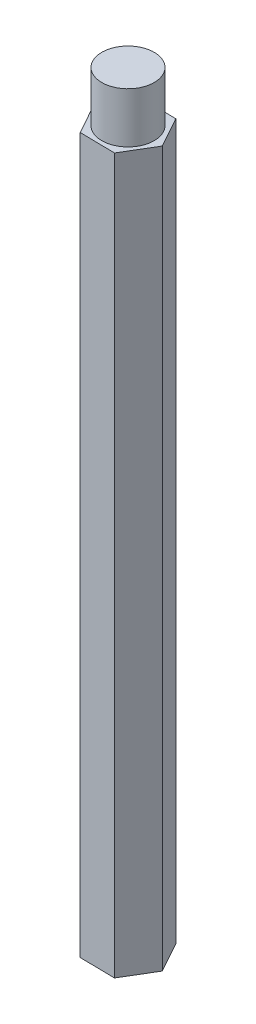
ISO-10303-21;
HEADER;
FILE_DESCRIPTION(('STEP AP214'),'2;1');
FILE_NAME('part.step','',(''),(''),'','','');
FILE_SCHEMA(('AUTOMOTIVE_DESIGN { 1 0 10303 214 1 1 1 1 }'));
ENDSEC;
DATA;
#1=APPLICATION_CONTEXT('core data for automotive mechanical design processes');
#2=APPLICATION_PROTOCOL_DEFINITION('international standard','automotive_design',2000,#1);
#3=PRODUCT_CONTEXT('',#1,'mechanical');
#4=PRODUCT('Part','Part','',(#3));
#5=PRODUCT_RELATED_PRODUCT_CATEGORY('part','',(#4));
#6=PRODUCT_DEFINITION_FORMATION('','',#4);
#7=PRODUCT_DEFINITION_CONTEXT('part definition',#1,'design');
#8=PRODUCT_DEFINITION('design','',#6,#7);
#9=PRODUCT_DEFINITION_SHAPE('','',#8);
#10=(LENGTH_UNIT() NAMED_UNIT(*) SI_UNIT(.MILLI.,.METRE.));
#11=(NAMED_UNIT(*) PLANE_ANGLE_UNIT() SI_UNIT($,.RADIAN.));
#12=(NAMED_UNIT(*) SI_UNIT($,.STERADIAN.) SOLID_ANGLE_UNIT());
#13=UNCERTAINTY_MEASURE_WITH_UNIT(LENGTH_MEASURE(1.E-05),#10,'distance_accuracy_value','');
#14=(GEOMETRIC_REPRESENTATION_CONTEXT(3) GLOBAL_UNCERTAINTY_ASSIGNED_CONTEXT((#13)) GLOBAL_UNIT_ASSIGNED_CONTEXT((#10,
#11,#12)) REPRESENTATION_CONTEXT('',''));
#15=CARTESIAN_POINT('',(0.,0.,0.));
#16=DIRECTION('',(0.,0.,1.));
#17=DIRECTION('',(1.,0.,0.));
#18=AXIS2_PLACEMENT_3D('',#15,#16,#17);
#19=CARTESIAN_POINT('',(-1.12669986382494,45.,1.88251978746312));
#20=DIRECTION('',(0.0157210096493327,0.,-0.99987641729146));
#21=DIRECTION('',(-0.99987641729146,0.,-0.0157210096493327));
#22=AXIS2_PLACEMENT_3D('',#19,#20,#21);
#23=PLANE('',#22);
#24=DIRECTION('',(0.99987641729146,0.,0.0157210096493327));
#25=VECTOR('',#24,1.);
#26=CARTESIAN_POINT('',(-1.12669986382494,0.,1.88251978746312));
#27=LINE('',#26,#25);
#28=CARTESIAN_POINT('',(-1.12669986382494,0.,1.88251978746312));
#29=VERTEX_POINT('',#28);
#30=CARTESIAN_POINT('',(1.06696002715747,0.,1.91701059824443));
#31=VERTEX_POINT('',#30);
#32=EDGE_CURVE('E119',#29,#31,#27,.T.);
#33=ORIENTED_EDGE('',*,*,#32,.T.);
#34=DIRECTION('',(0.,-1.,0.));
#35=VECTOR('',#34,1.);
#36=CARTESIAN_POINT('',(1.06696002715747,45.,1.91701059824443));
#37=LINE('',#36,#35);
#38=CARTESIAN_POINT('',(1.06696002715747,45.,1.91701059824443));
#39=VERTEX_POINT('',#38);
#40=EDGE_CURVE('E36',#39,#31,#37,.T.);
#41=ORIENTED_EDGE('',*,*,#40,.F.);
#42=DIRECTION('',(0.99987641729146,0.,0.0157210096493327));
#43=VECTOR('',#42,1.);
#44=CARTESIAN_POINT('',(-1.12669986382494,45.,1.88251978746312));
#45=LINE('',#44,#43);
#46=CARTESIAN_POINT('',(-1.12669986382494,45.,1.88251978746312));
#47=VERTEX_POINT('',#46);
#48=EDGE_CURVE('E130',#47,#39,#45,.T.);
#49=ORIENTED_EDGE('',*,*,#48,.F.);
#50=DIRECTION('',(0.,-1.,0.));
#51=VECTOR('',#50,1.);
#52=CARTESIAN_POINT('',(-1.12669986382494,45.,1.88251978746312));
#53=LINE('',#52,#51);
#54=EDGE_CURVE('E115',#47,#29,#53,.T.);
#55=ORIENTED_EDGE('',*,*,#54,.T.);
#56=EDGE_LOOP('',(#33,#41,#49,#55));
#57=FACE_BOUND('',#56,.T.);
#58=ADVANCED_FACE('F33',(#57),#23,.F.);
#59=CARTESIAN_POINT('',(1.06696002715747,45.,1.91701059824443));
#60=DIRECTION('',(-0.858057873194708,0.,-0.513553002375192));
#61=DIRECTION('',(-0.513553002375192,0.,0.858057873194708));
#62=AXIS2_PLACEMENT_3D('',#59,#60,#61);
#63=PLANE('',#62);
#64=DIRECTION('',(0.513553002375192,0.,-0.858057873194708));
#65=VECTOR('',#64,1.);
#66=CARTESIAN_POINT('',(1.06696002715747,0.,1.91701059824443));
#67=LINE('',#66,#65);
#68=CARTESIAN_POINT('',(2.19365989098241,0.,0.0344908107813044));
#69=VERTEX_POINT('',#68);
#70=EDGE_CURVE('E122',#31,#69,#67,.T.);
#71=ORIENTED_EDGE('',*,*,#70,.T.);
#72=DIRECTION('',(0.,-1.,0.));
#73=VECTOR('',#72,1.);
#74=CARTESIAN_POINT('',(2.19365989098241,45.,0.0344908107813044));
#75=LINE('',#74,#73);
#76=CARTESIAN_POINT('',(2.19365989098241,45.,0.0344908107813044));
#77=VERTEX_POINT('',#76);
#78=EDGE_CURVE('E133',#77,#69,#75,.T.);
#79=ORIENTED_EDGE('',*,*,#78,.F.);
#80=DIRECTION('',(0.513553002375192,0.,-0.858057873194708));
#81=VECTOR('',#80,1.);
#82=CARTESIAN_POINT('',(1.06696002715747,45.,1.91701059824443));
#83=LINE('',#82,#81);
#84=EDGE_CURVE('E88',#39,#77,#83,.T.);
#85=ORIENTED_EDGE('',*,*,#84,.F.);
#86=ORIENTED_EDGE('',*,*,#40,.T.);
#87=EDGE_LOOP('',(#71,#79,#85,#86));
#88=FACE_BOUND('',#87,.T.);
#89=ADVANCED_FACE('F138',(#88),#63,.F.);
#90=CARTESIAN_POINT('',(2.19365989098241,45.,0.0344908107813044));
#91=DIRECTION('',(-0.873778882844041,0.,0.486323414916268));
#92=DIRECTION('',(0.486323414916268,0.,0.873778882844041));
#93=AXIS2_PLACEMENT_3D('',#90,#91,#92);
#94=PLANE('',#93);
#95=DIRECTION('',(-0.486323414916268,0.,-0.873778882844041));
#96=VECTOR('',#95,1.);
#97=CARTESIAN_POINT('',(2.19365989098241,0.,0.0344908107813044));
#98=LINE('',#97,#96);
#99=CARTESIAN_POINT('',(1.12669986382494,0.,-1.88251978746312));
#100=VERTEX_POINT('',#99);
#101=EDGE_CURVE('E125',#69,#100,#98,.T.);
#102=ORIENTED_EDGE('',*,*,#101,.T.);
#103=DIRECTION('',(0.,-1.,0.));
#104=VECTOR('',#103,1.);
#105=CARTESIAN_POINT('',(1.12669986382494,45.,-1.88251978746312));
#106=LINE('',#105,#104);
#107=CARTESIAN_POINT('',(1.12669986382494,45.,-1.88251978746312));
#108=VERTEX_POINT('',#107);
#109=EDGE_CURVE('E110',#108,#100,#106,.T.);
#110=ORIENTED_EDGE('',*,*,#109,.F.);
#111=DIRECTION('',(-0.486323414916268,0.,-0.873778882844041));
#112=VECTOR('',#111,1.);
#113=CARTESIAN_POINT('',(2.19365989098241,45.,0.0344908107813044));
#114=LINE('',#113,#112);
#115=EDGE_CURVE('E101',#77,#108,#114,.T.);
#116=ORIENTED_EDGE('',*,*,#115,.F.);
#117=ORIENTED_EDGE('',*,*,#78,.T.);
#118=EDGE_LOOP('',(#102,#110,#116,#117));
#119=FACE_BOUND('',#118,.T.);
#120=ADVANCED_FACE('F144',(#119),#94,.F.);
#121=CARTESIAN_POINT('',(1.12669986382494,45.,-1.88251978746312));
#122=DIRECTION('',(-0.0157210096493326,0.,0.99987641729146));
#123=DIRECTION('',(0.99987641729146,0.,0.0157210096493326));
#124=AXIS2_PLACEMENT_3D('',#121,#122,#123);
#125=PLANE('',#124);
#126=DIRECTION('',(-0.99987641729146,0.,-0.0157210096493326));
#127=VECTOR('',#126,1.);
#128=CARTESIAN_POINT('',(1.12669986382494,0.,-1.88251978746312));
#129=LINE('',#128,#127);
#130=CARTESIAN_POINT('',(-1.06696002715748,0.,-1.91701059824443));
#131=VERTEX_POINT('',#130);
#132=EDGE_CURVE('E109',#100,#131,#129,.T.);
#133=ORIENTED_EDGE('',*,*,#132,.T.);
#134=DIRECTION('',(0.,-1.,0.));
#135=VECTOR('',#134,1.);
#136=CARTESIAN_POINT('',(-1.06696002715748,45.,-1.91701059824443));
#137=LINE('',#136,#135);
#138=CARTESIAN_POINT('',(-1.06696002715748,45.,-1.91701059824443));
#139=VERTEX_POINT('',#138);
#140=EDGE_CURVE('E106',#139,#131,#137,.T.);
#141=ORIENTED_EDGE('',*,*,#140,.F.);
#142=DIRECTION('',(-0.99987641729146,0.,-0.0157210096493326));
#143=VECTOR('',#142,1.);
#144=CARTESIAN_POINT('',(1.12669986382494,45.,-1.88251978746312));
#145=LINE('',#144,#143);
#146=EDGE_CURVE('E95',#108,#139,#145,.T.);
#147=ORIENTED_EDGE('',*,*,#146,.F.);
#148=ORIENTED_EDGE('',*,*,#109,.T.);
#149=EDGE_LOOP('',(#133,#141,#147,#148));
#150=FACE_BOUND('',#149,.T.);
#151=ADVANCED_FACE('F107',(#150),#125,.F.);
#152=CARTESIAN_POINT('',(-1.06696002715748,45.,-1.91701059824443));
#153=DIRECTION('',(0.858057873194708,0.,0.513553002375192));
#154=DIRECTION('',(0.513553002375193,0.,-0.858057873194708));
#155=AXIS2_PLACEMENT_3D('',#152,#153,#154);
#156=PLANE('',#155);
#157=DIRECTION('',(-0.513553002375192,0.,0.858057873194708));
#158=VECTOR('',#157,1.);
#159=CARTESIAN_POINT('',(-1.06696002715748,0.,-1.91701059824443));
#160=LINE('',#159,#158);
#161=CARTESIAN_POINT('',(-2.19365989098242,0.,-0.0344908107813043));
#162=VERTEX_POINT('',#161);
#163=EDGE_CURVE('E73',#131,#162,#160,.T.);
#164=ORIENTED_EDGE('',*,*,#163,.T.);
#165=DIRECTION('',(0.,-1.,0.));
#166=VECTOR('',#165,1.);
#167=CARTESIAN_POINT('',(-2.19365989098242,45.,-0.0344908107813043));
#168=LINE('',#167,#166);
#169=CARTESIAN_POINT('',(-2.19365989098242,45.,-0.0344908107813043));
#170=VERTEX_POINT('',#169);
#171=EDGE_CURVE('E111',#170,#162,#168,.T.);
#172=ORIENTED_EDGE('',*,*,#171,.F.);
#173=DIRECTION('',(-0.513553002375192,0.,0.858057873194708));
#174=VECTOR('',#173,1.);
#175=CARTESIAN_POINT('',(-1.06696002715748,45.,-1.91701059824443));
#176=LINE('',#175,#174);
#177=EDGE_CURVE('E99',#139,#170,#176,.T.);
#178=ORIENTED_EDGE('',*,*,#177,.F.);
#179=ORIENTED_EDGE('',*,*,#140,.T.);
#180=EDGE_LOOP('',(#164,#172,#178,#179));
#181=FACE_BOUND('',#180,.T.);
#182=ADVANCED_FACE('F113',(#181),#156,.F.);
#183=CARTESIAN_POINT('',(-2.19365989098242,45.,-0.0344908107813043));
#184=DIRECTION('',(0.873778882844041,0.,-0.486323414916268));
#185=DIRECTION('',(-0.486323414916268,0.,-0.873778882844041));
#186=AXIS2_PLACEMENT_3D('',#183,#184,#185);
#187=PLANE('',#186);
#188=DIRECTION('',(0.486323414916268,0.,0.873778882844041));
#189=VECTOR('',#188,1.);
#190=CARTESIAN_POINT('',(-2.19365989098242,0.,-0.0344908107813043));
#191=LINE('',#190,#189);
#192=EDGE_CURVE('E79',#162,#29,#191,.T.);
#193=ORIENTED_EDGE('',*,*,#192,.T.);
#194=ORIENTED_EDGE('',*,*,#54,.F.);
#195=DIRECTION('',(0.486323414916268,0.,0.873778882844041));
#196=VECTOR('',#195,1.);
#197=CARTESIAN_POINT('',(-2.19365989098242,45.,-0.0344908107813043));
#198=LINE('',#197,#196);
#199=EDGE_CURVE('E50',#170,#47,#198,.T.);
#200=ORIENTED_EDGE('',*,*,#199,.F.);
#201=ORIENTED_EDGE('',*,*,#171,.T.);
#202=EDGE_LOOP('',(#193,#194,#200,#201));
#203=FACE_BOUND('',#202,.T.);
#204=ADVANCED_FACE('F160',(#203),#187,.F.);
#205=CARTESIAN_POINT('',(0.,45.,0.));
#206=DIRECTION('',(0.,1.,0.));
#207=DIRECTION('',(0.,0.,1.));
#208=AXIS2_PLACEMENT_3D('',#205,#206,#207);
#209=PLANE('',#208);
#210=CARTESIAN_POINT('',(0.,45.,0.));
#211=DIRECTION('',(0.,1.,0.));
#212=DIRECTION('',(0.,0.,1.));
#213=AXIS2_PLACEMENT_3D('',#210,#211,#212);
#214=CIRCLE('',#213,1.65);
#215=CARTESIAN_POINT('',(0.,45.,1.65));
#216=VERTEX_POINT('',#215);
#217=EDGE_CURVE('E11',#216,#216,#214,.T.);
#218=ORIENTED_EDGE('',*,*,#217,.F.);
#219=EDGE_LOOP('',(#218));
#220=FACE_BOUND('',#219,.T.);
#221=ORIENTED_EDGE('',*,*,#48,.T.);
#222=ORIENTED_EDGE('',*,*,#84,.T.);
#223=ORIENTED_EDGE('',*,*,#115,.T.);
#224=ORIENTED_EDGE('',*,*,#146,.T.);
#225=ORIENTED_EDGE('',*,*,#177,.T.);
#226=ORIENTED_EDGE('',*,*,#199,.T.);
#227=EDGE_LOOP('',(#221,#222,#223,#224,#225,#226));
#228=FACE_BOUND('',#227,.T.);
#229=ADVANCED_FACE('F97',(#220,#228),#209,.T.);
#230=CARTESIAN_POINT('',(0.,0.,0.));
#231=DIRECTION('',(0.,1.,0.));
#232=DIRECTION('',(0.,0.,1.));
#233=AXIS2_PLACEMENT_3D('',#230,#231,#232);
#234=PLANE('',#233);
#235=ORIENTED_EDGE('',*,*,#32,.F.);
#236=ORIENTED_EDGE('',*,*,#192,.F.);
#237=ORIENTED_EDGE('',*,*,#163,.F.);
#238=ORIENTED_EDGE('',*,*,#132,.F.);
#239=ORIENTED_EDGE('',*,*,#101,.F.);
#240=ORIENTED_EDGE('',*,*,#70,.F.);
#241=EDGE_LOOP('',(#235,#236,#237,#238,#239,#240));
#242=FACE_BOUND('',#241,.T.);
#243=ADVANCED_FACE('F143',(#242),#234,.F.);
#244=CARTESIAN_POINT('',(0.,48.175,0.));
#245=DIRECTION('',(0.,-1.,0.));
#246=DIRECTION('',(0.,0.,-1.));
#247=AXIS2_PLACEMENT_3D('',#244,#245,#246);
#248=CYLINDRICAL_SURFACE('',#247,1.65);
#249=CARTESIAN_POINT('',(0.,48.175,0.));
#250=DIRECTION('',(0.,1.,0.));
#251=DIRECTION('',(0.,0.,1.));
#252=AXIS2_PLACEMENT_3D('',#249,#250,#251);
#253=CIRCLE('',#252,1.65);
#254=CARTESIAN_POINT('',(0.,48.175,1.65));
#255=VERTEX_POINT('',#254);
#256=EDGE_CURVE('E123',#255,#255,#253,.T.);
#257=ORIENTED_EDGE('',*,*,#256,.F.);
#258=EDGE_LOOP('',(#257));
#259=FACE_BOUND('',#258,.T.);
#260=ORIENTED_EDGE('',*,*,#217,.T.);
#261=EDGE_LOOP('',(#260));
#262=FACE_BOUND('',#261,.T.);
#263=ADVANCED_FACE('F153',(#259,#262),#248,.T.);
#264=CARTESIAN_POINT('',(0.,48.175,0.));
#265=DIRECTION('',(0.,1.,0.));
#266=DIRECTION('',(0.,0.,1.));
#267=AXIS2_PLACEMENT_3D('',#264,#265,#266);
#268=PLANE('',#267);
#269=ORIENTED_EDGE('',*,*,#256,.T.);
#270=EDGE_LOOP('',(#269));
#271=FACE_BOUND('',#270,.T.);
#272=ADVANCED_FACE('F151',(#271),#268,.T.);
#273=CLOSED_SHELL('',(#58,#89,#120,#151,#182,#204,#229,#243,#263,#272));
#274=MANIFOLD_SOLID_BREP('B2',#273);
#275=ADVANCED_BREP_SHAPE_REPRESENTATION('',(#18,#274),#14);
#276=SHAPE_DEFINITION_REPRESENTATION(#9,#275);
ENDSEC;
END-ISO-10303-21;
